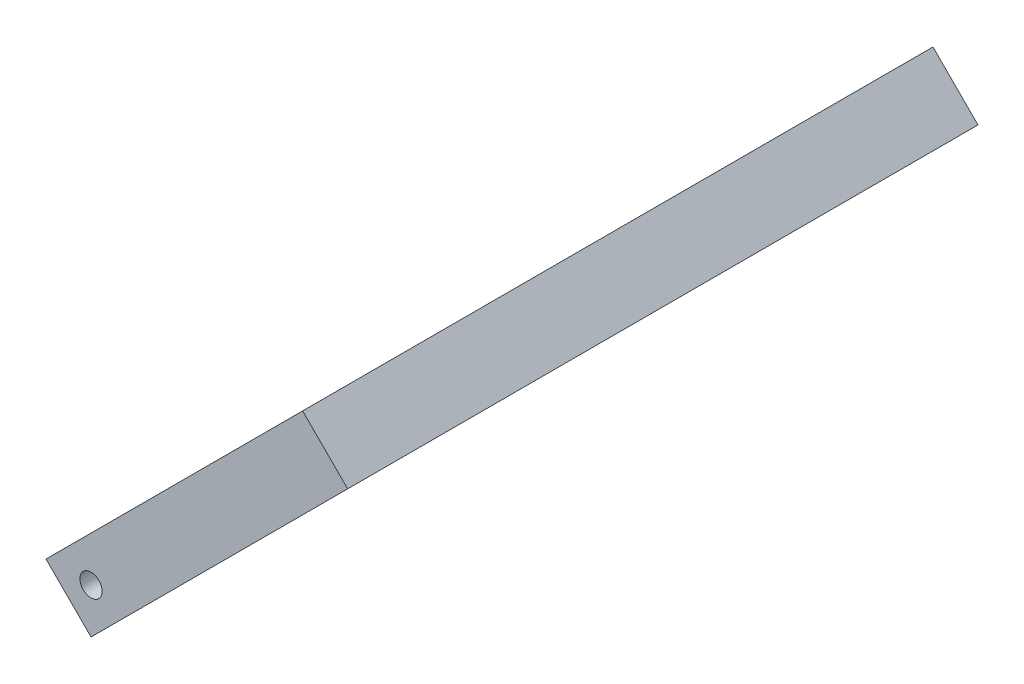
ISO-10303-21;
HEADER;
FILE_DESCRIPTION(('STEP AP214'),'2;1');
FILE_NAME('part.step','',(''),(''),'','','');
FILE_SCHEMA(('AUTOMOTIVE_DESIGN { 1 0 10303 214 1 1 1 1 }'));
ENDSEC;
DATA;
#1=APPLICATION_CONTEXT('core data for automotive mechanical design processes');
#2=APPLICATION_PROTOCOL_DEFINITION('international standard','automotive_design',2000,#1);
#3=PRODUCT_CONTEXT('',#1,'mechanical');
#4=PRODUCT('Part','Part','',(#3));
#5=PRODUCT_RELATED_PRODUCT_CATEGORY('part','',(#4));
#6=PRODUCT_DEFINITION_FORMATION('','',#4);
#7=PRODUCT_DEFINITION_CONTEXT('part definition',#1,'design');
#8=PRODUCT_DEFINITION('design','',#6,#7);
#9=PRODUCT_DEFINITION_SHAPE('','',#8);
#10=(LENGTH_UNIT() NAMED_UNIT(*) SI_UNIT(.MILLI.,.METRE.));
#11=(NAMED_UNIT(*) PLANE_ANGLE_UNIT() SI_UNIT($,.RADIAN.));
#12=(NAMED_UNIT(*) SI_UNIT($,.STERADIAN.) SOLID_ANGLE_UNIT());
#13=UNCERTAINTY_MEASURE_WITH_UNIT(LENGTH_MEASURE(1.E-05),#10,'distance_accuracy_value','');
#14=(GEOMETRIC_REPRESENTATION_CONTEXT(3) GLOBAL_UNCERTAINTY_ASSIGNED_CONTEXT((#13)) GLOBAL_UNIT_ASSIGNED_CONTEXT((#10,
#11,#12)) REPRESENTATION_CONTEXT('',''));
#15=CARTESIAN_POINT('',(0.,0.,0.));
#16=DIRECTION('',(0.,0.,1.));
#17=DIRECTION('',(1.,0.,0.));
#18=AXIS2_PLACEMENT_3D('',#15,#16,#17);
#19=CARTESIAN_POINT('',(100.409190479259,93.3381226673928,-5.));
#20=DIRECTION('',(0.707106781186546,-0.707106781186549,0.));
#21=DIRECTION('',(0.707106781186549,0.707106781186546,0.));
#22=AXIS2_PLACEMENT_3D('',#19,#20,#21);
#23=PLANE('',#22);
#24=DIRECTION('',(0.707106781186549,0.707106781186546,0.));
#25=VECTOR('',#24,1.);
#26=CARTESIAN_POINT('',(100.409190479259,93.3381226673928,-5.));
#27=LINE('',#26,#25);
#28=CARTESIAN_POINT('',(67.1751442127221,60.1040764008564,-5.));
#29=VERTEX_POINT('',#28);
#30=CARTESIAN_POINT('',(74.2462120245876,67.1751442127219,-5.));
#31=VERTEX_POINT('',#30);
#32=EDGE_CURVE('E108',#29,#31,#27,.T.);
#33=ORIENTED_EDGE('',*,*,#32,.T.);
#34=DIRECTION('',(0.640856382055789,0.640856382055786,-0.422618261740704));
#35=VECTOR('',#34,1.);
#36=CARTESIAN_POINT('',(74.2462120245876,67.1751442127219,-5.));
#37=LINE('',#36,#35);
#38=CARTESIAN_POINT('',(100.409190479259,93.3381226673928,-22.2534015203269));
#39=VERTEX_POINT('',#38);
#40=EDGE_CURVE('E105',#31,#39,#37,.T.);
#41=ORIENTED_EDGE('',*,*,#40,.T.);
#42=DIRECTION('',(0.,0.,-1.));
#43=VECTOR('',#42,1.);
#44=CARTESIAN_POINT('',(100.409190479259,93.3381226673928,0.));
#45=LINE('',#44,#43);
#46=CARTESIAN_POINT('',(100.409190479259,93.3381226673928,-99.0000000000011));
#47=VERTEX_POINT('',#46);
#48=EDGE_CURVE('E89',#39,#47,#45,.T.);
#49=ORIENTED_EDGE('',*,*,#48,.T.);
#50=DIRECTION('',(-0.707106781186548,-0.707106781186547,0.));
#51=VECTOR('',#50,1.);
#52=CARTESIAN_POINT('',(107.480258291124,100.409190479258,-99.0000000000011));
#53=LINE('',#52,#51);
#54=CARTESIAN_POINT('',(107.480258291124,100.409190479258,-99.0000000000011));
#55=VERTEX_POINT('',#54);
#56=EDGE_CURVE('E134',#55,#47,#53,.T.);
#57=ORIENTED_EDGE('',*,*,#56,.F.);
#58=DIRECTION('',(0.,0.,-1.));
#59=VECTOR('',#58,1.);
#60=CARTESIAN_POINT('',(107.480258291124,100.409190479258,0.));
#61=LINE('',#60,#59);
#62=CARTESIAN_POINT('',(107.480258291124,100.409190479258,0.));
#63=VERTEX_POINT('',#62);
#64=EDGE_CURVE('E121',#63,#55,#61,.T.);
#65=ORIENTED_EDGE('',*,*,#64,.F.);
#66=DIRECTION('',(0.707106781186549,0.707106781186546,0.));
#67=VECTOR('',#66,1.);
#68=CARTESIAN_POINT('',(100.409190479259,93.3381226673928,0.));
#69=LINE('',#68,#67);
#70=CARTESIAN_POINT('',(67.1751442127221,60.1040764008564,0.));
#71=VERTEX_POINT('',#70);
#72=EDGE_CURVE('E136',#71,#63,#69,.T.);
#73=ORIENTED_EDGE('',*,*,#72,.F.);
#74=DIRECTION('',(0.,0.,1.));
#75=VECTOR('',#74,1.);
#76=CARTESIAN_POINT('',(67.1751442127221,60.1040764008564,-5.));
#77=LINE('',#76,#75);
#78=EDGE_CURVE('E11',#29,#71,#77,.T.);
#79=ORIENTED_EDGE('',*,*,#78,.F.);
#80=EDGE_LOOP('',(#33,#41,#49,#57,#65,#73,#79));
#81=FACE_BOUND('',#80,.T.);
#82=ADVANCED_FACE('F33',(#81),#23,.T.);
#83=CARTESIAN_POINT('',(67.1751442127221,60.1040764008564,-5.));
#84=DIRECTION('',(-0.707106781186549,-0.707106781186547,0.));
#85=DIRECTION('',(0.707106781186546,-0.707106781186549,0.));
#86=AXIS2_PLACEMENT_3D('',#83,#84,#85);
#87=PLANE('',#86);
#88=DIRECTION('',(0.707106781186547,-0.707106781186549,0.));
#89=VECTOR('',#88,1.);
#90=CARTESIAN_POINT('',(67.1751442127221,60.1040764008564,0.));
#91=LINE('',#90,#89);
#92=CARTESIAN_POINT('',(60.1040764008567,67.1751442127219,0.));
#93=VERTEX_POINT('',#92);
#94=EDGE_CURVE('E138',#93,#71,#91,.T.);
#95=ORIENTED_EDGE('',*,*,#94,.F.);
#96=DIRECTION('',(0.,0.,1.));
#97=VECTOR('',#96,1.);
#98=CARTESIAN_POINT('',(60.1040764008567,67.1751442127219,-5.));
#99=LINE('',#98,#97);
#100=CARTESIAN_POINT('',(60.1040764008567,67.1751442127219,-5.));
#101=VERTEX_POINT('',#100);
#102=EDGE_CURVE('E36',#101,#93,#99,.T.);
#103=ORIENTED_EDGE('',*,*,#102,.F.);
#104=DIRECTION('',(0.707106781186547,-0.707106781186549,0.));
#105=VECTOR('',#104,1.);
#106=CARTESIAN_POINT('',(67.1751442127221,60.1040764008564,-5.));
#107=LINE('',#106,#105);
#108=EDGE_CURVE('E140',#101,#29,#107,.T.);
#109=ORIENTED_EDGE('',*,*,#108,.T.);
#110=ORIENTED_EDGE('',*,*,#78,.T.);
#111=EDGE_LOOP('',(#95,#103,#109,#110));
#112=FACE_BOUND('',#111,.T.);
#113=ADVANCED_FACE('F156',(#112),#87,.T.);
#114=CARTESIAN_POINT('',(60.1040764008567,67.1751442127219,-5.));
#115=DIRECTION('',(-0.707106781186547,0.707106781186548,0.));
#116=DIRECTION('',(-0.707106781186548,-0.707106781186547,0.));
#117=AXIS2_PLACEMENT_3D('',#114,#115,#116);
#118=PLANE('',#117);
#119=DIRECTION('',(0.640856382055788,0.640856382055786,-0.422618261740704));
#120=VECTOR('',#119,1.);
#121=CARTESIAN_POINT('',(67.1751442127222,74.2462120245874,-5.00000000000002));
#122=LINE('',#121,#120);
#123=CARTESIAN_POINT('',(67.1751442127221,74.2462120245873,-5.));
#124=VERTEX_POINT('',#123);
#125=CARTESIAN_POINT('',(93.3381226673931,100.409190479258,-22.2534015203269));
#126=VERTEX_POINT('',#125);
#127=EDGE_CURVE('E106',#124,#126,#122,.T.);
#128=ORIENTED_EDGE('',*,*,#127,.F.);
#129=DIRECTION('',(-0.707106781186548,-0.707106781186547,0.));
#130=VECTOR('',#129,1.);
#131=CARTESIAN_POINT('',(60.1040764008567,67.1751442127219,-5.));
#132=LINE('',#131,#130);
#133=EDGE_CURVE('E47',#124,#101,#132,.T.);
#134=ORIENTED_EDGE('',*,*,#133,.T.);
#135=ORIENTED_EDGE('',*,*,#102,.T.);
#136=DIRECTION('',(-0.707106781186548,-0.707106781186547,0.));
#137=VECTOR('',#136,1.);
#138=CARTESIAN_POINT('',(60.1040764008567,67.1751442127219,0.));
#139=LINE('',#138,#137);
#140=CARTESIAN_POINT('',(100.409190479259,107.480258291124,0.));
#141=VERTEX_POINT('',#140);
#142=EDGE_CURVE('E144',#141,#93,#139,.T.);
#143=ORIENTED_EDGE('',*,*,#142,.F.);
#144=DIRECTION('',(0.,0.,1.));
#145=VECTOR('',#144,1.);
#146=CARTESIAN_POINT('',(100.409190479259,107.480258291124,0.));
#147=LINE('',#146,#145);
#148=CARTESIAN_POINT('',(100.409190479259,107.480258291124,-99.0000000000011));
#149=VERTEX_POINT('',#148);
#150=EDGE_CURVE('E126',#149,#141,#147,.T.);
#151=ORIENTED_EDGE('',*,*,#150,.F.);
#152=DIRECTION('',(-0.707106781186548,-0.707106781186547,0.));
#153=VECTOR('',#152,1.);
#154=CARTESIAN_POINT('',(100.409190479259,107.480258291124,-99.0000000000011));
#155=LINE('',#154,#153);
#156=CARTESIAN_POINT('',(93.338122667393,100.409190479258,-99.0000000000011));
#157=VERTEX_POINT('',#156);
#158=EDGE_CURVE('E128',#149,#157,#155,.T.);
#159=ORIENTED_EDGE('',*,*,#158,.T.);
#160=DIRECTION('',(0.,0.,1.));
#161=VECTOR('',#160,1.);
#162=CARTESIAN_POINT('',(93.3381226673932,100.409190479258,0.));
#163=LINE('',#162,#161);
#164=EDGE_CURVE('E122',#157,#126,#163,.T.);
#165=ORIENTED_EDGE('',*,*,#164,.T.);
#166=EDGE_LOOP('',(#128,#134,#135,#143,#151,#159,#165));
#167=FACE_BOUND('',#166,.T.);
#168=ADVANCED_FACE('F163',(#167),#118,.T.);
#169=CARTESIAN_POINT('',(0.,0.,-5.));
#170=DIRECTION('',(0.,0.,-1.));
#171=DIRECTION('',(-1.,0.,0.));
#172=AXIS2_PLACEMENT_3D('',#169,#170,#171);
#173=PLANE('',#172);
#174=CARTESIAN_POINT('',(67.1751442127221,67.1751442127219,-5.));
#175=DIRECTION('',(0.,0.,-1.));
#176=DIRECTION('',(-1.,0.,0.));
#177=AXIS2_PLACEMENT_3D('',#174,#175,#176);
#178=CIRCLE('',#177,1.75);
#179=CARTESIAN_POINT('',(65.4251442127221,67.1751442127219,-5.));
#180=VERTEX_POINT('',#179);
#181=EDGE_CURVE('E109',#180,#180,#178,.T.);
#182=ORIENTED_EDGE('',*,*,#181,.F.);
#183=EDGE_LOOP('',(#182));
#184=FACE_BOUND('',#183,.T.);
#185=DIRECTION('',(0.707106781186546,-0.707106781186549,0.));
#186=VECTOR('',#185,1.);
#187=CARTESIAN_POINT('',(38.3074914915468,103.113864745763,-5.));
#188=LINE('',#187,#186);
#189=EDGE_CURVE('E52',#124,#31,#188,.T.);
#190=ORIENTED_EDGE('',*,*,#189,.T.);
#191=ORIENTED_EDGE('',*,*,#32,.F.);
#192=ORIENTED_EDGE('',*,*,#108,.F.);
#193=ORIENTED_EDGE('',*,*,#133,.F.);
#194=EDGE_LOOP('',(#190,#191,#192,#193));
#195=FACE_BOUND('',#194,.T.);
#196=ADVANCED_FACE('F173',(#184,#195),#173,.T.);
#197=CARTESIAN_POINT('',(0.,0.,0.));
#198=DIRECTION('',(0.,0.,-1.));
#199=DIRECTION('',(-1.,0.,0.));
#200=AXIS2_PLACEMENT_3D('',#197,#198,#199);
#201=PLANE('',#200);
#202=CARTESIAN_POINT('',(67.1751442127221,67.1751442127219,0.));
#203=DIRECTION('',(0.,0.,1.));
#204=DIRECTION('',(1.,0.,0.));
#205=AXIS2_PLACEMENT_3D('',#202,#203,#204);
#206=CIRCLE('',#205,1.75);
#207=CARTESIAN_POINT('',(68.9251442127221,67.1751442127219,0.));
#208=VERTEX_POINT('',#207);
#209=EDGE_CURVE('E113',#208,#208,#206,.T.);
#210=ORIENTED_EDGE('',*,*,#209,.F.);
#211=EDGE_LOOP('',(#210));
#212=FACE_BOUND('',#211,.T.);
#213=ORIENTED_EDGE('',*,*,#72,.T.);
#214=DIRECTION('',(0.707106781186547,-0.707106781186548,0.));
#215=VECTOR('',#214,1.);
#216=CARTESIAN_POINT('',(107.480258291124,100.409190479258,0.));
#217=LINE('',#216,#215);
#218=EDGE_CURVE('E118',#141,#63,#217,.T.);
#219=ORIENTED_EDGE('',*,*,#218,.F.);
#220=ORIENTED_EDGE('',*,*,#142,.T.);
#221=ORIENTED_EDGE('',*,*,#94,.T.);
#222=EDGE_LOOP('',(#213,#219,#220,#221));
#223=FACE_BOUND('',#222,.T.);
#224=ADVANCED_FACE('F150',(#212,#223),#201,.F.);
#225=CARTESIAN_POINT('',(107.480258291124,100.409190479258,-99.0000000000011));
#226=DIRECTION('',(0.,0.,1.));
#227=DIRECTION('',(1.,0.,0.));
#228=AXIS2_PLACEMENT_3D('',#225,#226,#227);
#229=PLANE('',#228);
#230=DIRECTION('',(-0.707106781186546,0.707106781186549,0.));
#231=VECTOR('',#230,1.);
#232=CARTESIAN_POINT('',(100.409190479259,93.3381226673928,-99.0000000000011));
#233=LINE('',#232,#231);
#234=EDGE_CURVE('E95',#47,#157,#233,.T.);
#235=ORIENTED_EDGE('',*,*,#234,.T.);
#236=ORIENTED_EDGE('',*,*,#158,.F.);
#237=DIRECTION('',(-0.707106781186546,0.707106781186549,0.));
#238=VECTOR('',#237,1.);
#239=CARTESIAN_POINT('',(107.480258291124,100.409190479258,-99.0000000000011));
#240=LINE('',#239,#238);
#241=EDGE_CURVE('E124',#55,#149,#240,.T.);
#242=ORIENTED_EDGE('',*,*,#241,.F.);
#243=ORIENTED_EDGE('',*,*,#56,.T.);
#244=EDGE_LOOP('',(#235,#236,#242,#243));
#245=FACE_BOUND('',#244,.T.);
#246=ADVANCED_FACE('F165',(#245),#229,.F.);
#247=CARTESIAN_POINT('',(103.944724385191,103.944724385191,0.));
#248=DIRECTION('',(-0.707106781186548,-0.707106781186547,0.));
#249=DIRECTION('',(0.707106781186547,-0.707106781186548,0.));
#250=AXIS2_PLACEMENT_3D('',#247,#248,#249);
#251=PLANE('',#250);
#252=ORIENTED_EDGE('',*,*,#218,.T.);
#253=ORIENTED_EDGE('',*,*,#64,.T.);
#254=ORIENTED_EDGE('',*,*,#241,.T.);
#255=ORIENTED_EDGE('',*,*,#150,.T.);
#256=EDGE_LOOP('',(#252,#253,#254,#255));
#257=FACE_BOUND('',#256,.T.);
#258=ADVANCED_FACE('F159',(#257),#251,.F.);
#259=CARTESIAN_POINT('',(96.8736565733258,96.8736565733256,0.));
#260=DIRECTION('',(-0.707106781186548,-0.707106781186547,0.));
#261=DIRECTION('',(0.707106781186547,-0.707106781186548,0.));
#262=AXIS2_PLACEMENT_3D('',#259,#260,#261);
#263=PLANE('',#262);
#264=DIRECTION('',(0.707106781186546,-0.707106781186549,0.));
#265=VECTOR('',#264,1.);
#266=CARTESIAN_POINT('',(64.4704699462178,129.276843200434,-22.2534015203269));
#267=LINE('',#266,#265);
#268=EDGE_CURVE('E93',#126,#39,#267,.T.);
#269=ORIENTED_EDGE('',*,*,#268,.F.);
#270=ORIENTED_EDGE('',*,*,#164,.F.);
#271=ORIENTED_EDGE('',*,*,#234,.F.);
#272=ORIENTED_EDGE('',*,*,#48,.F.);
#273=EDGE_LOOP('',(#269,#270,#271,#272));
#274=FACE_BOUND('',#273,.T.);
#275=ADVANCED_FACE('F91',(#274),#263,.T.);
#276=CARTESIAN_POINT('',(38.3074914915468,103.113864745763,-5.));
#277=DIRECTION('',(-0.298836238730123,-0.298836238730122,-0.906307787036648));
#278=DIRECTION('',(-0.949705125314944,0.,0.313145613014977));
#279=AXIS2_PLACEMENT_3D('',#276,#277,#278);
#280=PLANE('',#279);
#281=ORIENTED_EDGE('',*,*,#189,.F.);
#282=ORIENTED_EDGE('',*,*,#127,.T.);
#283=ORIENTED_EDGE('',*,*,#268,.T.);
#284=ORIENTED_EDGE('',*,*,#40,.F.);
#285=EDGE_LOOP('',(#281,#282,#283,#284));
#286=FACE_BOUND('',#285,.T.);
#287=ADVANCED_FACE('F104',(#286),#280,.T.);
#288=CARTESIAN_POINT('',(67.1751442127221,67.1751442127219,-99.0000000000011));
#289=DIRECTION('',(0.,0.,1.));
#290=DIRECTION('',(1.,0.,0.));
#291=AXIS2_PLACEMENT_3D('',#288,#289,#290);
#292=CYLINDRICAL_SURFACE('',#291,1.75);
#293=ORIENTED_EDGE('',*,*,#181,.T.);
#294=EDGE_LOOP('',(#293));
#295=FACE_BOUND('',#294,.T.);
#296=ORIENTED_EDGE('',*,*,#209,.T.);
#297=EDGE_LOOP('',(#296));
#298=FACE_BOUND('',#297,.T.);
#299=ADVANCED_FACE('F192',(#295,#298),#292,.F.);
#300=CLOSED_SHELL('',(#82,#113,#168,#196,#224,#246,#258,#275,#287,#299));
#301=MANIFOLD_SOLID_BREP('B2',#300);
#302=ADVANCED_BREP_SHAPE_REPRESENTATION('',(#18,#301),#14);
#303=SHAPE_DEFINITION_REPRESENTATION(#9,#302);
ENDSEC;
END-ISO-10303-21;
